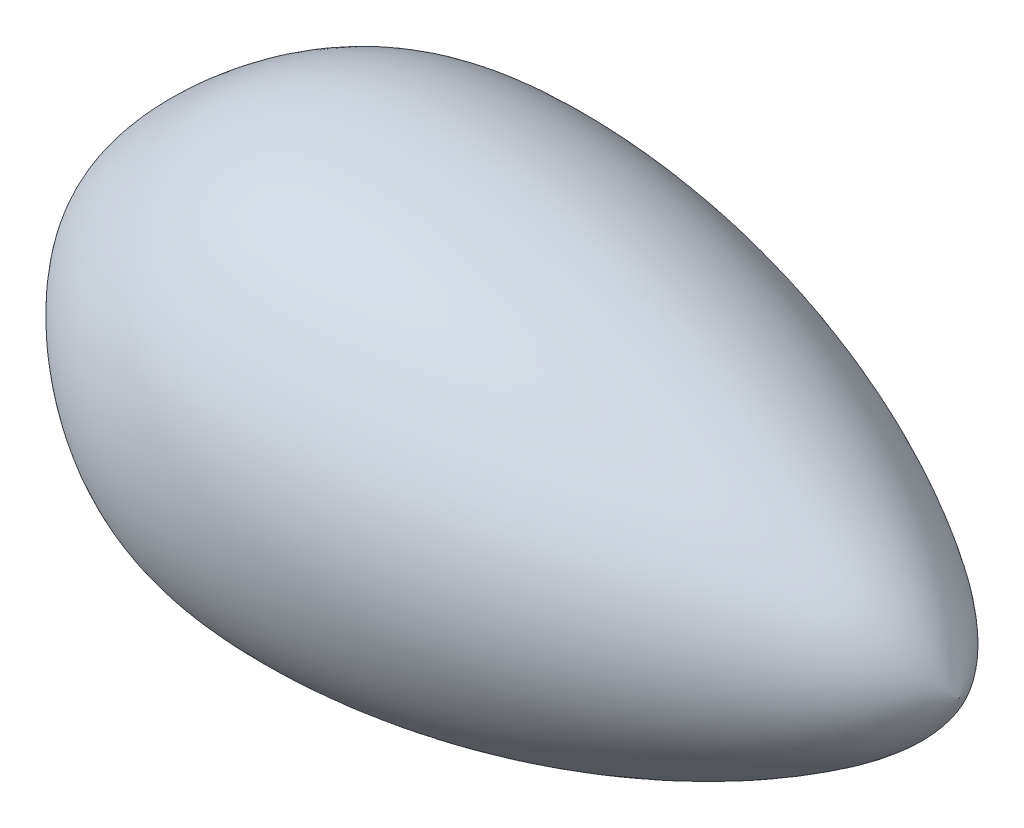
ISO-10303-21;
HEADER;
FILE_DESCRIPTION(('STEP AP214'),'2;1');
FILE_NAME('part.step','',(''),(''),'','','');
FILE_SCHEMA(('AUTOMOTIVE_DESIGN { 1 0 10303 214 1 1 1 1 }'));
ENDSEC;
DATA;
#1=APPLICATION_CONTEXT('core data for automotive mechanical design processes');
#2=APPLICATION_PROTOCOL_DEFINITION('international standard','automotive_design',2000,#1);
#3=PRODUCT_CONTEXT('',#1,'mechanical');
#4=PRODUCT('Part','Part','',(#3));
#5=PRODUCT_RELATED_PRODUCT_CATEGORY('part','',(#4));
#6=PRODUCT_DEFINITION_FORMATION('','',#4);
#7=PRODUCT_DEFINITION_CONTEXT('part definition',#1,'design');
#8=PRODUCT_DEFINITION('design','',#6,#7);
#9=PRODUCT_DEFINITION_SHAPE('','',#8);
#10=(LENGTH_UNIT() NAMED_UNIT(*) SI_UNIT(.MILLI.,.METRE.));
#11=(NAMED_UNIT(*) PLANE_ANGLE_UNIT() SI_UNIT($,.RADIAN.));
#12=(NAMED_UNIT(*) SI_UNIT($,.STERADIAN.) SOLID_ANGLE_UNIT());
#13=UNCERTAINTY_MEASURE_WITH_UNIT(LENGTH_MEASURE(1.E-05),#10,'distance_accuracy_value','');
#14=(GEOMETRIC_REPRESENTATION_CONTEXT(3) GLOBAL_UNCERTAINTY_ASSIGNED_CONTEXT((#13)) GLOBAL_UNIT_ASSIGNED_CONTEXT((#10,
#11,#12)) REPRESENTATION_CONTEXT('',''));
#15=CARTESIAN_POINT('',(0.,0.,0.));
#16=DIRECTION('',(0.,0.,1.));
#17=DIRECTION('',(1.,0.,0.));
#18=AXIS2_PLACEMENT_3D('',#15,#16,#17);
#19=CARTESIAN_POINT('',(2370.,0.,3.19046370400811E-13));
#20=CARTESIAN_POINT('',(2319.87090468205,0.,-127.330816596073));
#21=CARTESIAN_POINT('',(1909.85785184233,0.,-454.428714376606));
#22=CARTESIAN_POINT('',(1076.41684280092,0.,-685.903289482764));
#23=CARTESIAN_POINT('',(368.518299359601,0.,-571.44086391747));
#24=CARTESIAN_POINT('',(3.12779461213462,0.,-179.122704387943));
#25=CARTESIAN_POINT('',(4.70418722896067,0.,-30.0005931644236));
#26=CARTESIAN_POINT('',(0.,0.,0.));
#27=B_SPLINE_CURVE_WITH_KNOTS('',3,(#19,#20,#21,#22,#23,#24,#25,#26),.UNSPECIFIED.,.F.,.F.,(4,1,
1,1,1,4),(0.,0.144061430274928,0.597199346399658,0.777786436862665,0.957583052707582,1.),.UNSPECIFIED.);
#28=CARTESIAN_POINT('',(-269.615809875745,0.,0.));
#29=DIRECTION('',(-1.,0.,0.));
#30=AXIS1_PLACEMENT('',#28,#29);
#31=SURFACE_OF_REVOLUTION('',#27,#30);
#32=CARTESIAN_POINT('',(0.,0.,0.));
#33=VERTEX_POINT('',#32);
#34=VERTEX_LOOP('',#33);
#35=FACE_BOUND('',#34,.T.);
#36=CARTESIAN_POINT('',(2370.,0.,0.));
#37=VERTEX_POINT('',#36);
#38=VERTEX_LOOP('',#37);
#39=FACE_BOUND('',#38,.T.);
#40=ADVANCED_FACE('F48',(#35,#39),#31,.T.);
#41=CLOSED_SHELL('',(#40));
#42=MANIFOLD_SOLID_BREP('B2',#41);
#43=ADVANCED_BREP_SHAPE_REPRESENTATION('',(#18,#42),#14);
#44=SHAPE_DEFINITION_REPRESENTATION(#9,#43);
ENDSEC;
END-ISO-10303-21;
